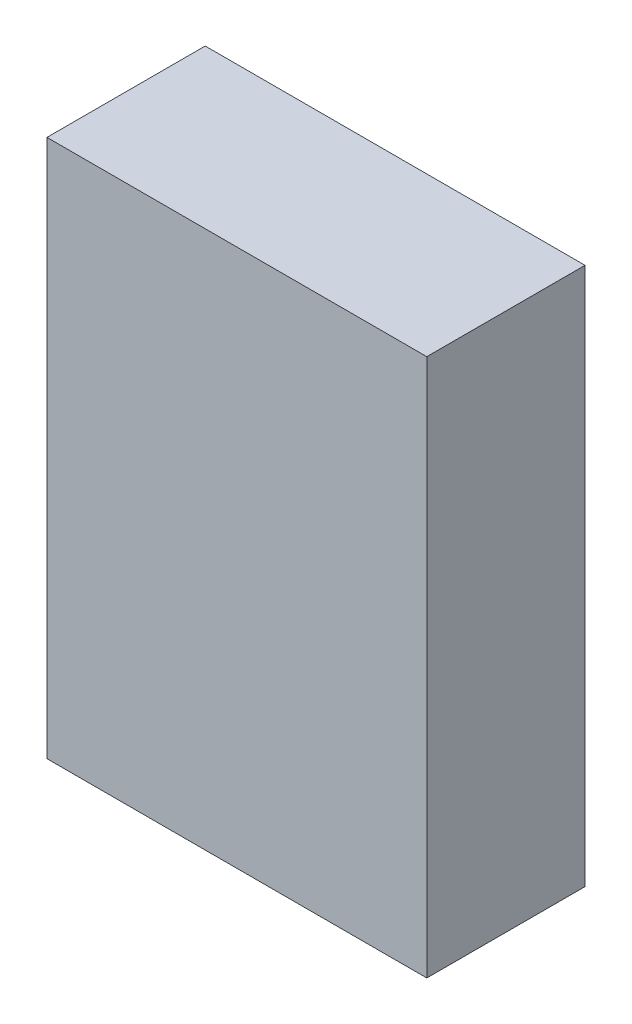
ISO-10303-21;
HEADER;
FILE_DESCRIPTION(('STEP AP214'),'2;1');
FILE_NAME('part.step','',(''),(''),'','','');
FILE_SCHEMA(('AUTOMOTIVE_DESIGN { 1 0 10303 214 1 1 1 1 }'));
ENDSEC;
DATA;
#1=APPLICATION_CONTEXT('core data for automotive mechanical design processes');
#2=APPLICATION_PROTOCOL_DEFINITION('international standard','automotive_design',2000,#1);
#3=PRODUCT_CONTEXT('',#1,'mechanical');
#4=PRODUCT('Part','Part','',(#3));
#5=PRODUCT_RELATED_PRODUCT_CATEGORY('part','',(#4));
#6=PRODUCT_DEFINITION_FORMATION('','',#4);
#7=PRODUCT_DEFINITION_CONTEXT('part definition',#1,'design');
#8=PRODUCT_DEFINITION('design','',#6,#7);
#9=PRODUCT_DEFINITION_SHAPE('','',#8);
#10=(LENGTH_UNIT() NAMED_UNIT(*) SI_UNIT(.MILLI.,.METRE.));
#11=(NAMED_UNIT(*) PLANE_ANGLE_UNIT() SI_UNIT($,.RADIAN.));
#12=(NAMED_UNIT(*) SI_UNIT($,.STERADIAN.) SOLID_ANGLE_UNIT());
#13=UNCERTAINTY_MEASURE_WITH_UNIT(LENGTH_MEASURE(1.E-05),#10,'distance_accuracy_value','');
#14=(GEOMETRIC_REPRESENTATION_CONTEXT(3) GLOBAL_UNCERTAINTY_ASSIGNED_CONTEXT((#13)) GLOBAL_UNIT_ASSIGNED_CONTEXT((#10,
#11,#12)) REPRESENTATION_CONTEXT('',''));
#15=CARTESIAN_POINT('',(0.,0.,0.));
#16=DIRECTION('',(0.,0.,1.));
#17=DIRECTION('',(1.,0.,0.));
#18=AXIS2_PLACEMENT_3D('',#15,#16,#17);
#19=CARTESIAN_POINT('',(0.13,-2.92,0.));
#20=DIRECTION('',(1.,0.,0.));
#21=DIRECTION('',(0.,0.,1.));
#22=AXIS2_PLACEMENT_3D('',#19,#20,#21);
#23=PLANE('',#22);
#24=DIRECTION('',(0.,1.,0.));
#25=VECTOR('',#24,1.);
#26=CARTESIAN_POINT('',(0.13,-2.92,0.1));
#27=LINE('',#26,#25);
#28=CARTESIAN_POINT('',(0.13,-2.92,0.1));
#29=VERTEX_POINT('',#28);
#30=CARTESIAN_POINT('',(0.13,-2.58,0.1));
#31=VERTEX_POINT('',#30);
#32=EDGE_CURVE('E11',#29,#31,#27,.T.);
#33=ORIENTED_EDGE('',*,*,#32,.T.);
#34=DIRECTION('',(0.,0.,1.));
#35=VECTOR('',#34,1.);
#36=CARTESIAN_POINT('',(0.13,-2.58,0.));
#37=LINE('',#36,#35);
#38=CARTESIAN_POINT('',(0.13,-2.58,0.));
#39=VERTEX_POINT('',#38);
#40=EDGE_CURVE('E24',#39,#31,#37,.T.);
#41=ORIENTED_EDGE('',*,*,#40,.F.);
#42=DIRECTION('',(0.,1.,0.));
#43=VECTOR('',#42,1.);
#44=CARTESIAN_POINT('',(0.13,-2.92,0.));
#45=LINE('',#44,#43);
#46=CARTESIAN_POINT('',(0.13,-2.92,0.));
#47=VERTEX_POINT('',#46);
#48=EDGE_CURVE('E86',#47,#39,#45,.T.);
#49=ORIENTED_EDGE('',*,*,#48,.F.);
#50=DIRECTION('',(0.,0.,1.));
#51=VECTOR('',#50,1.);
#52=CARTESIAN_POINT('',(0.13,-2.92,0.));
#53=LINE('',#52,#51);
#54=EDGE_CURVE('E36',#47,#29,#53,.T.);
#55=ORIENTED_EDGE('',*,*,#54,.T.);
#56=EDGE_LOOP('',(#33,#41,#49,#55));
#57=FACE_BOUND('',#56,.T.);
#58=ADVANCED_FACE('F17',(#57),#23,.F.);
#59=CARTESIAN_POINT('',(0.37,-2.92,0.));
#60=DIRECTION('',(1.,0.,0.));
#61=DIRECTION('',(0.,0.,1.));
#62=AXIS2_PLACEMENT_3D('',#59,#60,#61);
#63=PLANE('',#62);
#64=DIRECTION('',(0.,0.,1.));
#65=VECTOR('',#64,1.);
#66=CARTESIAN_POINT('',(0.37,-2.92,0.));
#67=LINE('',#66,#65);
#68=CARTESIAN_POINT('',(0.37,-2.92,0.));
#69=VERTEX_POINT('',#68);
#70=CARTESIAN_POINT('',(0.37,-2.92,0.1));
#71=VERTEX_POINT('',#70);
#72=EDGE_CURVE('E83',#69,#71,#67,.T.);
#73=ORIENTED_EDGE('',*,*,#72,.F.);
#74=DIRECTION('',(0.,1.,0.));
#75=VECTOR('',#74,1.);
#76=CARTESIAN_POINT('',(0.37,-2.92,0.));
#77=LINE('',#76,#75);
#78=CARTESIAN_POINT('',(0.37,-2.58,0.));
#79=VERTEX_POINT('',#78);
#80=EDGE_CURVE('E63',#69,#79,#77,.T.);
#81=ORIENTED_EDGE('',*,*,#80,.T.);
#82=DIRECTION('',(0.,0.,1.));
#83=VECTOR('',#82,1.);
#84=CARTESIAN_POINT('',(0.37,-2.58,0.));
#85=LINE('',#84,#83);
#86=CARTESIAN_POINT('',(0.37,-2.58,0.1));
#87=VERTEX_POINT('',#86);
#88=EDGE_CURVE('E57',#79,#87,#85,.T.);
#89=ORIENTED_EDGE('',*,*,#88,.T.);
#90=DIRECTION('',(0.,1.,0.));
#91=VECTOR('',#90,1.);
#92=CARTESIAN_POINT('',(0.37,-2.92,0.1));
#93=LINE('',#92,#91);
#94=EDGE_CURVE('E60',#71,#87,#93,.T.);
#95=ORIENTED_EDGE('',*,*,#94,.F.);
#96=EDGE_LOOP('',(#73,#81,#89,#95));
#97=FACE_BOUND('',#96,.T.);
#98=ADVANCED_FACE('F59',(#97),#63,.T.);
#99=CARTESIAN_POINT('',(0.13,-2.92,0.));
#100=DIRECTION('',(0.,1.,0.));
#101=DIRECTION('',(0.,0.,1.));
#102=AXIS2_PLACEMENT_3D('',#99,#100,#101);
#103=PLANE('',#102);
#104=ORIENTED_EDGE('',*,*,#72,.T.);
#105=DIRECTION('',(1.,0.,0.));
#106=VECTOR('',#105,1.);
#107=CARTESIAN_POINT('',(0.13,-2.92,0.1));
#108=LINE('',#107,#106);
#109=EDGE_CURVE('E71',#29,#71,#108,.T.);
#110=ORIENTED_EDGE('',*,*,#109,.F.);
#111=ORIENTED_EDGE('',*,*,#54,.F.);
#112=DIRECTION('',(1.,0.,0.));
#113=VECTOR('',#112,1.);
#114=CARTESIAN_POINT('',(0.13,-2.92,0.));
#115=LINE('',#114,#113);
#116=EDGE_CURVE('E76',#47,#69,#115,.T.);
#117=ORIENTED_EDGE('',*,*,#116,.T.);
#118=EDGE_LOOP('',(#104,#110,#111,#117));
#119=FACE_BOUND('',#118,.T.);
#120=ADVANCED_FACE('F91',(#119),#103,.F.);
#121=CARTESIAN_POINT('',(0.13,-2.58,0.));
#122=DIRECTION('',(0.,1.,0.));
#123=DIRECTION('',(0.,0.,1.));
#124=AXIS2_PLACEMENT_3D('',#121,#122,#123);
#125=PLANE('',#124);
#126=DIRECTION('',(1.,0.,0.));
#127=VECTOR('',#126,1.);
#128=CARTESIAN_POINT('',(0.13,-2.58,0.));
#129=LINE('',#128,#127);
#130=EDGE_CURVE('E74',#39,#79,#129,.T.);
#131=ORIENTED_EDGE('',*,*,#130,.F.);
#132=ORIENTED_EDGE('',*,*,#40,.T.);
#133=DIRECTION('',(1.,0.,0.));
#134=VECTOR('',#133,1.);
#135=CARTESIAN_POINT('',(0.13,-2.58,0.1));
#136=LINE('',#135,#134);
#137=EDGE_CURVE('E69',#31,#87,#136,.T.);
#138=ORIENTED_EDGE('',*,*,#137,.T.);
#139=ORIENTED_EDGE('',*,*,#88,.F.);
#140=EDGE_LOOP('',(#131,#132,#138,#139));
#141=FACE_BOUND('',#140,.T.);
#142=ADVANCED_FACE('F73',(#141),#125,.T.);
#143=CARTESIAN_POINT('',(0.13,-2.92,0.));
#144=DIRECTION('',(0.,0.,1.));
#145=DIRECTION('',(1.,0.,0.));
#146=AXIS2_PLACEMENT_3D('',#143,#144,#145);
#147=PLANE('',#146);
#148=ORIENTED_EDGE('',*,*,#130,.T.);
#149=ORIENTED_EDGE('',*,*,#80,.F.);
#150=ORIENTED_EDGE('',*,*,#116,.F.);
#151=ORIENTED_EDGE('',*,*,#48,.T.);
#152=EDGE_LOOP('',(#148,#149,#150,#151));
#153=FACE_BOUND('',#152,.T.);
#154=ADVANCED_FACE('F89',(#153),#147,.F.);
#155=CARTESIAN_POINT('',(0.13,-2.92,0.1));
#156=DIRECTION('',(0.,0.,1.));
#157=DIRECTION('',(1.,0.,0.));
#158=AXIS2_PLACEMENT_3D('',#155,#156,#157);
#159=PLANE('',#158);
#160=ORIENTED_EDGE('',*,*,#32,.F.);
#161=ORIENTED_EDGE('',*,*,#109,.T.);
#162=ORIENTED_EDGE('',*,*,#94,.T.);
#163=ORIENTED_EDGE('',*,*,#137,.F.);
#164=EDGE_LOOP('',(#160,#161,#162,#163));
#165=FACE_BOUND('',#164,.T.);
#166=ADVANCED_FACE('F68',(#165),#159,.T.);
#167=CLOSED_SHELL('',(#58,#98,#120,#142,#154,#166));
#168=MANIFOLD_SOLID_BREP('B1',#167);
#169=ADVANCED_BREP_SHAPE_REPRESENTATION('',(#18,#168),#14);
#170=SHAPE_DEFINITION_REPRESENTATION(#9,#169);
ENDSEC;
END-ISO-10303-21;
